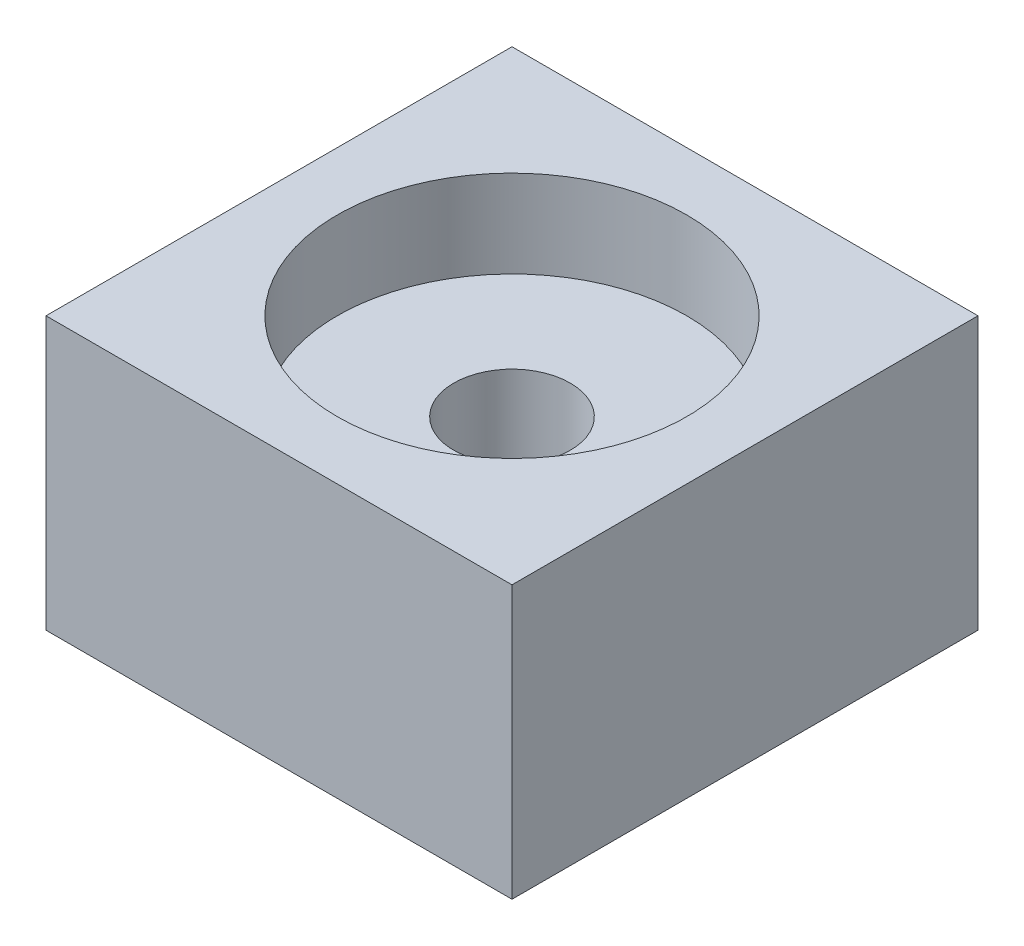
ISO-10303-21;
HEADER;
FILE_DESCRIPTION(('STEP AP214'),'2;1');
FILE_NAME('part.step','',(''),(''),'','','');
FILE_SCHEMA(('AUTOMOTIVE_DESIGN { 1 0 10303 214 1 1 1 1 }'));
ENDSEC;
DATA;
#1=APPLICATION_CONTEXT('core data for automotive mechanical design processes');
#2=APPLICATION_PROTOCOL_DEFINITION('international standard','automotive_design',2000,#1);
#3=PRODUCT_CONTEXT('',#1,'mechanical');
#4=PRODUCT('Part','Part','',(#3));
#5=PRODUCT_RELATED_PRODUCT_CATEGORY('part','',(#4));
#6=PRODUCT_DEFINITION_FORMATION('','',#4);
#7=PRODUCT_DEFINITION_CONTEXT('part definition',#1,'design');
#8=PRODUCT_DEFINITION('design','',#6,#7);
#9=PRODUCT_DEFINITION_SHAPE('','',#8);
#10=(LENGTH_UNIT() NAMED_UNIT(*) SI_UNIT(.MILLI.,.METRE.));
#11=(NAMED_UNIT(*) PLANE_ANGLE_UNIT() SI_UNIT($,.RADIAN.));
#12=(NAMED_UNIT(*) SI_UNIT($,.STERADIAN.) SOLID_ANGLE_UNIT());
#13=UNCERTAINTY_MEASURE_WITH_UNIT(LENGTH_MEASURE(1.E-05),#10,'distance_accuracy_value','');
#14=(GEOMETRIC_REPRESENTATION_CONTEXT(3) GLOBAL_UNCERTAINTY_ASSIGNED_CONTEXT((#13)) GLOBAL_UNIT_ASSIGNED_CONTEXT((#10,
#11,#12)) REPRESENTATION_CONTEXT('',''));
#15=CARTESIAN_POINT('',(0.,0.,0.));
#16=DIRECTION('',(0.,0.,1.));
#17=DIRECTION('',(1.,0.,0.));
#18=AXIS2_PLACEMENT_3D('',#15,#16,#17);
#19=CARTESIAN_POINT('',(0.,3.,0.));
#20=DIRECTION('',(0.,-1.,0.));
#21=DIRECTION('',(0.,0.,-1.));
#22=AXIS2_PLACEMENT_3D('',#19,#20,#21);
#23=PLANE('',#22);
#24=DIRECTION('',(0.,0.,1.));
#25=VECTOR('',#24,1.);
#26=CARTESIAN_POINT('',(0.,3.,0.));
#27=LINE('',#26,#25);
#28=CARTESIAN_POINT('',(0.,3.,-16.));
#29=VERTEX_POINT('',#28);
#30=CARTESIAN_POINT('',(0.,3.,0.));
#31=VERTEX_POINT('',#30);
#32=EDGE_CURVE('E84',#29,#31,#27,.T.);
#33=ORIENTED_EDGE('',*,*,#32,.T.);
#34=DIRECTION('',(1.,0.,0.));
#35=VECTOR('',#34,1.);
#36=CARTESIAN_POINT('',(0.,3.,0.));
#37=LINE('',#36,#35);
#38=CARTESIAN_POINT('',(16.,3.,0.));
#39=VERTEX_POINT('',#38);
#40=EDGE_CURVE('E116',#31,#39,#37,.T.);
#41=ORIENTED_EDGE('',*,*,#40,.T.);
#42=DIRECTION('',(0.,0.,-1.));
#43=VECTOR('',#42,1.);
#44=CARTESIAN_POINT('',(16.,3.,0.));
#45=LINE('',#44,#43);
#46=CARTESIAN_POINT('',(16.,3.,-16.));
#47=VERTEX_POINT('',#46);
#48=EDGE_CURVE('E59',#39,#47,#45,.T.);
#49=ORIENTED_EDGE('',*,*,#48,.T.);
#50=DIRECTION('',(-1.,0.,0.));
#51=VECTOR('',#50,1.);
#52=CARTESIAN_POINT('',(0.,3.,-16.));
#53=LINE('',#52,#51);
#54=EDGE_CURVE('E54',#47,#29,#53,.T.);
#55=ORIENTED_EDGE('',*,*,#54,.T.);
#56=EDGE_LOOP('',(#33,#41,#49,#55));
#57=FACE_BOUND('',#56,.T.);
#58=CARTESIAN_POINT('',(8.,3.,-8.));
#59=DIRECTION('',(0.,1.,0.));
#60=DIRECTION('',(0.,0.,1.));
#61=AXIS2_PLACEMENT_3D('',#58,#59,#60);
#62=CIRCLE('',#61,6.00000000000001);
#63=CARTESIAN_POINT('',(8.,3.,-1.99999999999999));
#64=VERTEX_POINT('',#63);
#65=EDGE_CURVE('E110',#64,#64,#62,.T.);
#66=ORIENTED_EDGE('',*,*,#65,.F.);
#67=EDGE_LOOP('',(#66));
#68=FACE_BOUND('',#67,.T.);
#69=ADVANCED_FACE('F39',(#57,#68),#23,.F.);
#70=CARTESIAN_POINT('',(0.,3.,0.));
#71=DIRECTION('',(1.,0.,0.));
#72=DIRECTION('',(0.,0.,-1.));
#73=AXIS2_PLACEMENT_3D('',#70,#71,#72);
#74=PLANE('',#73);
#75=DIRECTION('',(0.,-1.,0.));
#76=VECTOR('',#75,1.);
#77=CARTESIAN_POINT('',(0.,3.,-16.));
#78=LINE('',#77,#76);
#79=CARTESIAN_POINT('',(0.,-6.35,-16.));
#80=VERTEX_POINT('',#79);
#81=EDGE_CURVE('E79',#29,#80,#78,.T.);
#82=ORIENTED_EDGE('',*,*,#81,.T.);
#83=DIRECTION('',(0.,0.,-1.));
#84=VECTOR('',#83,1.);
#85=CARTESIAN_POINT('',(0.,-6.35,0.));
#86=LINE('',#85,#84);
#87=CARTESIAN_POINT('',(0.,-6.35,0.));
#88=VERTEX_POINT('',#87);
#89=EDGE_CURVE('E83',#88,#80,#86,.T.);
#90=ORIENTED_EDGE('',*,*,#89,.F.);
#91=DIRECTION('',(0.,-1.,0.));
#92=VECTOR('',#91,1.);
#93=CARTESIAN_POINT('',(0.,3.,0.));
#94=LINE('',#93,#92);
#95=EDGE_CURVE('E11',#31,#88,#94,.T.);
#96=ORIENTED_EDGE('',*,*,#95,.F.);
#97=ORIENTED_EDGE('',*,*,#32,.F.);
#98=EDGE_LOOP('',(#82,#90,#96,#97));
#99=FACE_BOUND('',#98,.T.);
#100=ADVANCED_FACE('F41',(#99),#74,.F.);
#101=CARTESIAN_POINT('',(0.,3.,0.));
#102=DIRECTION('',(0.,0.,-1.));
#103=DIRECTION('',(-1.,0.,0.));
#104=AXIS2_PLACEMENT_3D('',#101,#102,#103);
#105=PLANE('',#104);
#106=ORIENTED_EDGE('',*,*,#95,.T.);
#107=DIRECTION('',(-1.,0.,0.));
#108=VECTOR('',#107,1.);
#109=CARTESIAN_POINT('',(0.,-6.35,0.));
#110=LINE('',#109,#108);
#111=CARTESIAN_POINT('',(16.,-6.35,0.));
#112=VERTEX_POINT('',#111);
#113=EDGE_CURVE('E99',#112,#88,#110,.T.);
#114=ORIENTED_EDGE('',*,*,#113,.F.);
#115=DIRECTION('',(0.,-1.,0.));
#116=VECTOR('',#115,1.);
#117=CARTESIAN_POINT('',(16.,3.,0.));
#118=LINE('',#117,#116);
#119=EDGE_CURVE('E47',#39,#112,#118,.T.);
#120=ORIENTED_EDGE('',*,*,#119,.F.);
#121=ORIENTED_EDGE('',*,*,#40,.F.);
#122=EDGE_LOOP('',(#106,#114,#120,#121));
#123=FACE_BOUND('',#122,.T.);
#124=ADVANCED_FACE('F124',(#123),#105,.F.);
#125=CARTESIAN_POINT('',(16.,3.,0.));
#126=DIRECTION('',(-1.,0.,0.));
#127=DIRECTION('',(0.,0.,1.));
#128=AXIS2_PLACEMENT_3D('',#125,#126,#127);
#129=PLANE('',#128);
#130=ORIENTED_EDGE('',*,*,#119,.T.);
#131=DIRECTION('',(0.,0.,1.));
#132=VECTOR('',#131,1.);
#133=CARTESIAN_POINT('',(16.,-6.35,0.));
#134=LINE('',#133,#132);
#135=CARTESIAN_POINT('',(16.,-6.35,-16.));
#136=VERTEX_POINT('',#135);
#137=EDGE_CURVE('E94',#136,#112,#134,.T.);
#138=ORIENTED_EDGE('',*,*,#137,.F.);
#139=DIRECTION('',(0.,-1.,0.));
#140=VECTOR('',#139,1.);
#141=CARTESIAN_POINT('',(16.,3.,-16.));
#142=LINE('',#141,#140);
#143=EDGE_CURVE('E86',#47,#136,#142,.T.);
#144=ORIENTED_EDGE('',*,*,#143,.F.);
#145=ORIENTED_EDGE('',*,*,#48,.F.);
#146=EDGE_LOOP('',(#130,#138,#144,#145));
#147=FACE_BOUND('',#146,.T.);
#148=ADVANCED_FACE('F122',(#147),#129,.F.);
#149=CARTESIAN_POINT('',(0.,3.,-16.));
#150=DIRECTION('',(0.,0.,1.));
#151=DIRECTION('',(1.,0.,0.));
#152=AXIS2_PLACEMENT_3D('',#149,#150,#151);
#153=PLANE('',#152);
#154=ORIENTED_EDGE('',*,*,#143,.T.);
#155=DIRECTION('',(1.,0.,0.));
#156=VECTOR('',#155,1.);
#157=CARTESIAN_POINT('',(0.,-6.35,-16.));
#158=LINE('',#157,#156);
#159=EDGE_CURVE('E89',#80,#136,#158,.T.);
#160=ORIENTED_EDGE('',*,*,#159,.F.);
#161=ORIENTED_EDGE('',*,*,#81,.F.);
#162=ORIENTED_EDGE('',*,*,#54,.F.);
#163=EDGE_LOOP('',(#154,#160,#161,#162));
#164=FACE_BOUND('',#163,.T.);
#165=ADVANCED_FACE('F90',(#164),#153,.F.);
#166=CARTESIAN_POINT('',(8.,3.,-8.));
#167=DIRECTION('',(0.,-1.,0.));
#168=DIRECTION('',(0.,0.,-1.));
#169=AXIS2_PLACEMENT_3D('',#166,#167,#168);
#170=CYLINDRICAL_SURFACE('',#169,6.00000000000001);
#171=ORIENTED_EDGE('',*,*,#65,.T.);
#172=EDGE_LOOP('',(#171));
#173=FACE_BOUND('',#172,.T.);
#174=CARTESIAN_POINT('',(8.,0.,-8.));
#175=DIRECTION('',(0.,1.,0.));
#176=DIRECTION('',(0.,0.,1.));
#177=AXIS2_PLACEMENT_3D('',#174,#175,#176);
#178=CIRCLE('',#177,6.00000000000001);
#179=CARTESIAN_POINT('',(8.,0.,-1.99999999999999));
#180=VERTEX_POINT('',#179);
#181=EDGE_CURVE('E109',#180,#180,#178,.T.);
#182=ORIENTED_EDGE('',*,*,#181,.F.);
#183=EDGE_LOOP('',(#182));
#184=FACE_BOUND('',#183,.T.);
#185=ADVANCED_FACE('F130',(#173,#184),#170,.F.);
#186=CARTESIAN_POINT('',(0.,0.,0.));
#187=DIRECTION('',(0.,-1.,0.));
#188=DIRECTION('',(0.,0.,-1.));
#189=AXIS2_PLACEMENT_3D('',#186,#187,#188);
#190=PLANE('',#189);
#191=CARTESIAN_POINT('',(8.,0.,-8.));
#192=DIRECTION('',(0.,-1.,0.));
#193=DIRECTION('',(0.,0.,-1.));
#194=AXIS2_PLACEMENT_3D('',#191,#192,#193);
#195=CIRCLE('',#194,2.);
#196=CARTESIAN_POINT('',(8.,0.,-10.));
#197=VERTEX_POINT('',#196);
#198=EDGE_CURVE('E100',#197,#197,#195,.T.);
#199=ORIENTED_EDGE('',*,*,#198,.T.);
#200=EDGE_LOOP('',(#199));
#201=FACE_BOUND('',#200,.T.);
#202=ORIENTED_EDGE('',*,*,#181,.T.);
#203=EDGE_LOOP('',(#202));
#204=FACE_BOUND('',#203,.T.);
#205=ADVANCED_FACE('F133',(#201,#204),#190,.F.);
#206=CARTESIAN_POINT('',(0.,-6.35,0.));
#207=DIRECTION('',(0.,-1.,0.));
#208=DIRECTION('',(0.,0.,-1.));
#209=AXIS2_PLACEMENT_3D('',#206,#207,#208);
#210=PLANE('',#209);
#211=CARTESIAN_POINT('',(8.,-6.35,-8.));
#212=DIRECTION('',(0.,-1.,0.));
#213=DIRECTION('',(0.,0.,-1.));
#214=AXIS2_PLACEMENT_3D('',#211,#212,#213);
#215=CIRCLE('',#214,2.);
#216=CARTESIAN_POINT('',(8.,-6.35,-10.));
#217=VERTEX_POINT('',#216);
#218=EDGE_CURVE('E103',#217,#217,#215,.T.);
#219=ORIENTED_EDGE('',*,*,#218,.F.);
#220=EDGE_LOOP('',(#219));
#221=FACE_BOUND('',#220,.T.);
#222=ORIENTED_EDGE('',*,*,#89,.T.);
#223=ORIENTED_EDGE('',*,*,#159,.T.);
#224=ORIENTED_EDGE('',*,*,#137,.T.);
#225=ORIENTED_EDGE('',*,*,#113,.T.);
#226=EDGE_LOOP('',(#222,#223,#224,#225));
#227=FACE_BOUND('',#226,.T.);
#228=ADVANCED_FACE('F97',(#221,#227),#210,.T.);
#229=CARTESIAN_POINT('',(8.,0.,-8.));
#230=DIRECTION('',(0.,-1.,0.));
#231=DIRECTION('',(0.,0.,-1.));
#232=AXIS2_PLACEMENT_3D('',#229,#230,#231);
#233=CYLINDRICAL_SURFACE('',#232,2.);
#234=ORIENTED_EDGE('',*,*,#198,.F.);
#235=EDGE_LOOP('',(#234));
#236=FACE_BOUND('',#235,.T.);
#237=ORIENTED_EDGE('',*,*,#218,.T.);
#238=EDGE_LOOP('',(#237));
#239=FACE_BOUND('',#238,.T.);
#240=ADVANCED_FACE('F143',(#236,#239),#233,.F.);
#241=CLOSED_SHELL('',(#69,#100,#124,#148,#165,#185,#205,#228,#240));
#242=MANIFOLD_SOLID_BREP('B2',#241);
#243=ADVANCED_BREP_SHAPE_REPRESENTATION('',(#18,#242),#14);
#244=SHAPE_DEFINITION_REPRESENTATION(#9,#243);
ENDSEC;
END-ISO-10303-21;
